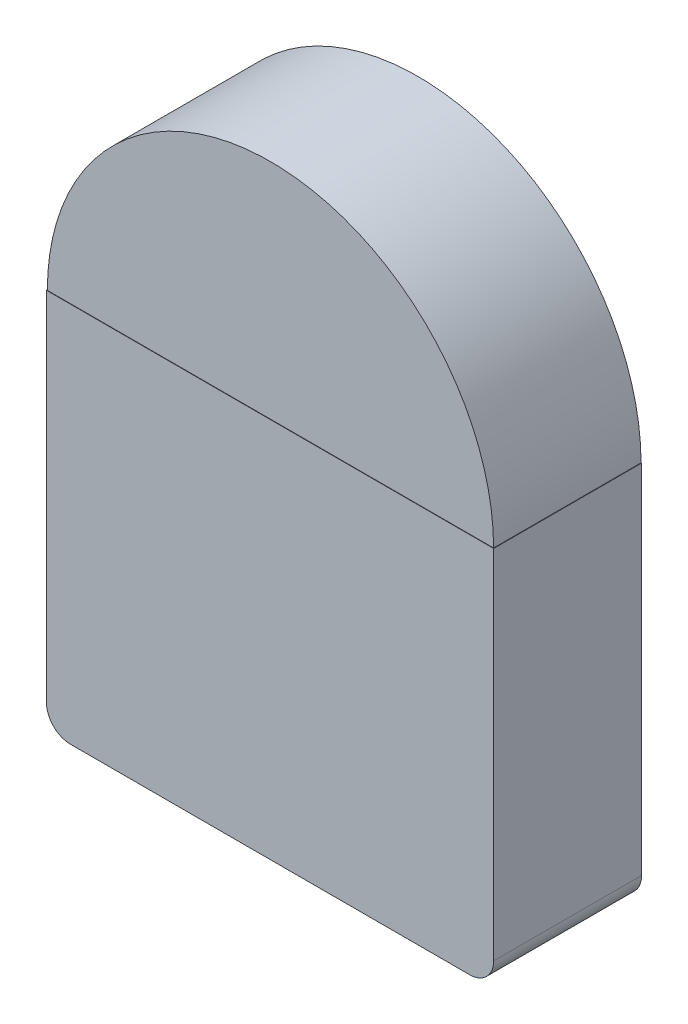
ISO-10303-21;
HEADER;
FILE_DESCRIPTION(('STEP AP214'),'2;1');
FILE_NAME('part.step','',(''),(''),'','','');
FILE_SCHEMA(('AUTOMOTIVE_DESIGN { 1 0 10303 214 1 1 1 1 }'));
ENDSEC;
DATA;
#1=APPLICATION_CONTEXT('core data for automotive mechanical design processes');
#2=APPLICATION_PROTOCOL_DEFINITION('international standard','automotive_design',2000,#1);
#3=PRODUCT_CONTEXT('',#1,'mechanical');
#4=PRODUCT('Part','Part','',(#3));
#5=PRODUCT_RELATED_PRODUCT_CATEGORY('part','',(#4));
#6=PRODUCT_DEFINITION_FORMATION('','',#4);
#7=PRODUCT_DEFINITION_CONTEXT('part definition',#1,'design');
#8=PRODUCT_DEFINITION('design','',#6,#7);
#9=PRODUCT_DEFINITION_SHAPE('','',#8);
#10=(LENGTH_UNIT() NAMED_UNIT(*) SI_UNIT(.MILLI.,.METRE.));
#11=(NAMED_UNIT(*) PLANE_ANGLE_UNIT() SI_UNIT($,.RADIAN.));
#12=(NAMED_UNIT(*) SI_UNIT($,.STERADIAN.) SOLID_ANGLE_UNIT());
#13=UNCERTAINTY_MEASURE_WITH_UNIT(LENGTH_MEASURE(1.E-05),#10,'distance_accuracy_value','');
#14=(GEOMETRIC_REPRESENTATION_CONTEXT(3) GLOBAL_UNCERTAINTY_ASSIGNED_CONTEXT((#13)) GLOBAL_UNIT_ASSIGNED_CONTEXT((#10,
#11,#12)) REPRESENTATION_CONTEXT('',''));
#15=CARTESIAN_POINT('',(0.,0.,0.));
#16=DIRECTION('',(0.,0.,1.));
#17=DIRECTION('',(1.,0.,0.));
#18=AXIS2_PLACEMENT_3D('',#15,#16,#17);
#19=CARTESIAN_POINT('',(-0.00127246753999985,0.,0.));
#20=DIRECTION('',(0.,0.,1.));
#21=DIRECTION('',(1.,0.,0.));
#22=AXIS2_PLACEMENT_3D('',#19,#20,#21);
#23=CYLINDRICAL_SURFACE('',#22,9.29);
#24=DIRECTION('',(0.,0.,-1.));
#25=VECTOR('',#24,1.);
#26=CARTESIAN_POINT('',(-9.29127246754,0.,1.5));
#27=LINE('',#26,#25);
#28=CARTESIAN_POINT('',(-9.29127246754,0.,6.14));
#29=VERTEX_POINT('',#28);
#30=CARTESIAN_POINT('',(-9.29127246754,0.,0.));
#31=VERTEX_POINT('',#30);
#32=EDGE_CURVE('E122',#29,#31,#27,.T.);
#33=ORIENTED_EDGE('',*,*,#32,.F.);
#34=CARTESIAN_POINT('',(-0.00127246753999985,0.,6.14));
#35=DIRECTION('',(0.,0.,1.));
#36=DIRECTION('',(1.,0.,0.));
#37=AXIS2_PLACEMENT_3D('',#34,#35,#36);
#38=CIRCLE('',#37,9.29);
#39=CARTESIAN_POINT('',(9.28872753246,0.,6.14));
#40=VERTEX_POINT('',#39);
#41=EDGE_CURVE('E110',#40,#29,#38,.T.);
#42=ORIENTED_EDGE('',*,*,#41,.F.);
#43=DIRECTION('',(0.,0.,-1.));
#44=VECTOR('',#43,1.);
#45=CARTESIAN_POINT('',(9.28872753246,0.,1.5));
#46=LINE('',#45,#44);
#47=CARTESIAN_POINT('',(9.28872753246,0.,0.));
#48=VERTEX_POINT('',#47);
#49=EDGE_CURVE('E125',#40,#48,#46,.T.);
#50=ORIENTED_EDGE('',*,*,#49,.T.);
#51=CARTESIAN_POINT('',(-0.00127246753999985,0.,0.));
#52=DIRECTION('',(0.,0.,1.));
#53=DIRECTION('',(1.,0.,0.));
#54=AXIS2_PLACEMENT_3D('',#51,#52,#53);
#55=CIRCLE('',#54,9.29);
#56=EDGE_CURVE('E131',#48,#31,#55,.T.);
#57=ORIENTED_EDGE('',*,*,#56,.T.);
#58=EDGE_LOOP('',(#33,#42,#50,#57));
#59=FACE_BOUND('',#58,.T.);
#60=ADVANCED_FACE('F45',(#59),#23,.T.);
#61=CARTESIAN_POINT('',(9.28872753246,0.,0.));
#62=DIRECTION('',(0.,0.,-1.));
#63=DIRECTION('',(-1.,0.,0.));
#64=AXIS2_PLACEMENT_3D('',#61,#62,#63);
#65=PLANE('',#64);
#66=DIRECTION('',(1.,0.,0.));
#67=VECTOR('',#66,1.);
#68=CARTESIAN_POINT('',(9.3087275324599,-15.8700000000001,0.));
#69=LINE('',#68,#67);
#70=CARTESIAN_POINT('',(-8.3112724675401,-15.8699999999999,0.));
#71=VERTEX_POINT('',#70);
#72=CARTESIAN_POINT('',(8.3087275324599,-15.8700000000001,0.));
#73=VERTEX_POINT('',#72);
#74=EDGE_CURVE('E175',#71,#73,#69,.T.);
#75=ORIENTED_EDGE('',*,*,#74,.F.);
#76=CARTESIAN_POINT('',(-8.31127246754009,-14.8699999999999,0.));
#77=DIRECTION('',(0.,0.,-1.));
#78=DIRECTION('',(-1.,0.,0.));
#79=AXIS2_PLACEMENT_3D('',#76,#77,#78);
#80=CIRCLE('',#79,1.);
#81=CARTESIAN_POINT('',(-9.31127246754009,-14.8699999999999,0.));
#82=VERTEX_POINT('',#81);
#83=EDGE_CURVE('E155',#71,#82,#80,.T.);
#84=ORIENTED_EDGE('',*,*,#83,.T.);
#85=DIRECTION('',(0.,1.,0.));
#86=VECTOR('',#85,1.);
#87=CARTESIAN_POINT('',(-9.3112724675401,-15.8699999999999,0.));
#88=LINE('',#87,#86);
#89=CARTESIAN_POINT('',(-9.31127246754,0.,0.));
#90=VERTEX_POINT('',#89);
#91=EDGE_CURVE('E181',#82,#90,#88,.T.);
#92=ORIENTED_EDGE('',*,*,#91,.T.);
#93=DIRECTION('',(1.,0.,0.));
#94=VECTOR('',#93,1.);
#95=CARTESIAN_POINT('',(9.30872753246,0.,0.));
#96=LINE('',#95,#94);
#97=EDGE_CURVE('E176',#90,#31,#96,.T.);
#98=ORIENTED_EDGE('',*,*,#97,.T.);
#99=ORIENTED_EDGE('',*,*,#56,.F.);
#100=CARTESIAN_POINT('',(9.30872753246,0.,0.));
#101=VERTEX_POINT('',#100);
#102=EDGE_CURVE('E195',#48,#101,#96,.T.);
#103=ORIENTED_EDGE('',*,*,#102,.T.);
#104=DIRECTION('',(0.,1.,0.));
#105=VECTOR('',#104,1.);
#106=CARTESIAN_POINT('',(9.3087275324599,-15.8700000000001,0.));
#107=LINE('',#106,#105);
#108=CARTESIAN_POINT('',(9.30872753245991,-14.8700000000001,0.));
#109=VERTEX_POINT('',#108);
#110=EDGE_CURVE('E187',#109,#101,#107,.T.);
#111=ORIENTED_EDGE('',*,*,#110,.F.);
#112=CARTESIAN_POINT('',(8.30872753245991,-14.8700000000001,0.));
#113=DIRECTION('',(0.,0.,-1.));
#114=DIRECTION('',(-1.,0.,0.));
#115=AXIS2_PLACEMENT_3D('',#112,#113,#114);
#116=CIRCLE('',#115,1.);
#117=EDGE_CURVE('E152',#109,#73,#116,.T.);
#118=ORIENTED_EDGE('',*,*,#117,.T.);
#119=EDGE_LOOP('',(#75,#84,#92,#98,#99,#103,#111,#118));
#120=FACE_BOUND('',#119,.T.);
#121=ADVANCED_FACE('F180',(#120),#65,.T.);
#122=CARTESIAN_POINT('',(9.3087275324599,-15.8700000000001,6.15669391474474));
#123=DIRECTION('',(-1.,0.,0.));
#124=DIRECTION('',(0.,-1.,0.));
#125=AXIS2_PLACEMENT_3D('',#122,#123,#124);
#126=PLANE('',#125);
#127=DIRECTION('',(0.,1.,0.));
#128=VECTOR('',#127,1.);
#129=CARTESIAN_POINT('',(9.3087275324599,-15.8700000000001,6.15669391474474));
#130=LINE('',#129,#128);
#131=CARTESIAN_POINT('',(9.30872753245991,-14.8700000000001,6.15669391474474));
#132=VERTEX_POINT('',#131);
#133=CARTESIAN_POINT('',(9.30872753246,0.,6.15669391474473));
#134=VERTEX_POINT('',#133);
#135=EDGE_CURVE('E133',#132,#134,#130,.T.);
#136=ORIENTED_EDGE('',*,*,#135,.F.);
#137=DIRECTION('',(0.,0.,1.));
#138=VECTOR('',#137,1.);
#139=CARTESIAN_POINT('',(9.30872753245991,-14.8700000000001,6.15669391474474));
#140=LINE('',#139,#138);
#141=EDGE_CURVE('E12',#132,#109,#140,.F.);
#142=ORIENTED_EDGE('',*,*,#141,.T.);
#143=ORIENTED_EDGE('',*,*,#110,.T.);
#144=DIRECTION('',(0.,0.,1.));
#145=VECTOR('',#144,1.);
#146=CARTESIAN_POINT('',(9.30872753246,0.,6.15669391474473));
#147=LINE('',#146,#145);
#148=EDGE_CURVE('E127',#101,#134,#147,.T.);
#149=ORIENTED_EDGE('',*,*,#148,.T.);
#150=EDGE_LOOP('',(#136,#142,#143,#149));
#151=FACE_BOUND('',#150,.T.);
#152=ADVANCED_FACE('F210',(#151),#126,.F.);
#153=CARTESIAN_POINT('',(-9.3112724675401,-15.8699999999999,6.15669391474474));
#154=DIRECTION('',(0.,0.,-1.));
#155=DIRECTION('',(0.,1.,0.));
#156=AXIS2_PLACEMENT_3D('',#153,#154,#155);
#157=PLANE('',#156);
#158=DIRECTION('',(0.,1.,0.));
#159=VECTOR('',#158,1.);
#160=CARTESIAN_POINT('',(-9.3112724675401,-15.8699999999999,6.15669391474474));
#161=LINE('',#160,#159);
#162=CARTESIAN_POINT('',(-9.31127246754009,-14.8699999999999,6.15669391474474));
#163=VERTEX_POINT('',#162);
#164=CARTESIAN_POINT('',(-9.31127246754,0.,6.15669391474473));
#165=VERTEX_POINT('',#164);
#166=EDGE_CURVE('E138',#163,#165,#161,.T.);
#167=ORIENTED_EDGE('',*,*,#166,.F.);
#168=CARTESIAN_POINT('',(-8.31127246754009,-14.8699999999999,6.15669391474474));
#169=DIRECTION('',(0.,0.,-1.));
#170=DIRECTION('',(0.,1.,0.));
#171=AXIS2_PLACEMENT_3D('',#168,#169,#170);
#172=CIRCLE('',#171,1.);
#173=CARTESIAN_POINT('',(-8.3112724675401,-15.8699999999999,6.15669391474474));
#174=VERTEX_POINT('',#173);
#175=EDGE_CURVE('E54',#163,#174,#172,.F.);
#176=ORIENTED_EDGE('',*,*,#175,.T.);
#177=DIRECTION('',(-1.,0.,0.));
#178=VECTOR('',#177,1.);
#179=CARTESIAN_POINT('',(-9.3112724675401,-15.8699999999999,6.15669391474474));
#180=LINE('',#179,#178);
#181=CARTESIAN_POINT('',(8.3087275324599,-15.87,6.15669391474474));
#182=VERTEX_POINT('',#181);
#183=EDGE_CURVE('E165',#182,#174,#180,.T.);
#184=ORIENTED_EDGE('',*,*,#183,.F.);
#185=CARTESIAN_POINT('',(8.30872753245991,-14.87,6.15669391474474));
#186=DIRECTION('',(0.,0.,-1.));
#187=DIRECTION('',(0.,1.,0.));
#188=AXIS2_PLACEMENT_3D('',#185,#186,#187);
#189=CIRCLE('',#188,1.);
#190=EDGE_CURVE('E61',#182,#132,#189,.F.);
#191=ORIENTED_EDGE('',*,*,#190,.T.);
#192=ORIENTED_EDGE('',*,*,#135,.T.);
#193=DIRECTION('',(-1.,0.,0.));
#194=VECTOR('',#193,1.);
#195=CARTESIAN_POINT('',(-9.31127246754,0.,6.15669391474473));
#196=LINE('',#195,#194);
#197=EDGE_CURVE('E198',#134,#165,#196,.T.);
#198=ORIENTED_EDGE('',*,*,#197,.T.);
#199=EDGE_LOOP('',(#167,#176,#184,#191,#192,#198));
#200=FACE_BOUND('',#199,.T.);
#201=ADVANCED_FACE('F164',(#200),#157,.F.);
#202=CARTESIAN_POINT('',(-9.3112724675401,-15.8699999999999,0.));
#203=DIRECTION('',(1.,0.,0.));
#204=DIRECTION('',(0.,1.,0.));
#205=AXIS2_PLACEMENT_3D('',#202,#203,#204);
#206=PLANE('',#205);
#207=ORIENTED_EDGE('',*,*,#91,.F.);
#208=DIRECTION('',(0.,0.,-1.));
#209=VECTOR('',#208,1.);
#210=CARTESIAN_POINT('',(-9.31127246754009,-14.8699999999999,0.));
#211=LINE('',#210,#209);
#212=EDGE_CURVE('E69',#82,#163,#211,.F.);
#213=ORIENTED_EDGE('',*,*,#212,.T.);
#214=ORIENTED_EDGE('',*,*,#166,.T.);
#215=DIRECTION('',(0.,0.,-1.));
#216=VECTOR('',#215,1.);
#217=CARTESIAN_POINT('',(-9.31127246754,0.,0.));
#218=LINE('',#217,#216);
#219=EDGE_CURVE('E185',#165,#90,#218,.T.);
#220=ORIENTED_EDGE('',*,*,#219,.T.);
#221=EDGE_LOOP('',(#207,#213,#214,#220));
#222=FACE_BOUND('',#221,.T.);
#223=ADVANCED_FACE('F183',(#222),#206,.F.);
#224=CARTESIAN_POINT('',(0.,-15.87,0.));
#225=DIRECTION('',(0.,1.,0.));
#226=DIRECTION('',(-1.,0.,0.));
#227=AXIS2_PLACEMENT_3D('',#224,#225,#226);
#228=PLANE('',#227);
#229=ORIENTED_EDGE('',*,*,#183,.T.);
#230=DIRECTION('',(0.,0.,-1.));
#231=VECTOR('',#230,1.);
#232=CARTESIAN_POINT('',(-8.3112724675401,-15.8699999999999,0.));
#233=LINE('',#232,#231);
#234=EDGE_CURVE('E148',#174,#71,#233,.T.);
#235=ORIENTED_EDGE('',*,*,#234,.T.);
#236=ORIENTED_EDGE('',*,*,#74,.T.);
#237=DIRECTION('',(0.,0.,1.));
#238=VECTOR('',#237,1.);
#239=CARTESIAN_POINT('',(8.3087275324599,-15.8700000000001,0.));
#240=LINE('',#239,#238);
#241=EDGE_CURVE('E144',#73,#182,#240,.T.);
#242=ORIENTED_EDGE('',*,*,#241,.T.);
#243=EDGE_LOOP('',(#229,#235,#236,#242));
#244=FACE_BOUND('',#243,.T.);
#245=ADVANCED_FACE('F170',(#244),#228,.F.);
#246=CARTESIAN_POINT('',(0.,0.,0.));
#247=DIRECTION('',(0.,1.,0.));
#248=DIRECTION('',(-1.,0.,0.));
#249=AXIS2_PLACEMENT_3D('',#246,#247,#248);
#250=PLANE('',#249);
#251=DIRECTION('',(1.,0.,0.));
#252=VECTOR('',#251,1.);
#253=CARTESIAN_POINT('',(-9.29127246754,0.,6.14));
#254=LINE('',#253,#252);
#255=EDGE_CURVE('E113',#29,#40,#254,.T.);
#256=ORIENTED_EDGE('',*,*,#255,.F.);
#257=ORIENTED_EDGE('',*,*,#32,.T.);
#258=ORIENTED_EDGE('',*,*,#97,.F.);
#259=ORIENTED_EDGE('',*,*,#219,.F.);
#260=ORIENTED_EDGE('',*,*,#197,.F.);
#261=ORIENTED_EDGE('',*,*,#148,.F.);
#262=ORIENTED_EDGE('',*,*,#102,.F.);
#263=ORIENTED_EDGE('',*,*,#49,.F.);
#264=EDGE_LOOP('',(#256,#257,#258,#259,#260,#261,#262,#263));
#265=FACE_BOUND('',#264,.T.);
#266=ADVANCED_FACE('F120',(#265),#250,.T.);
#267=CARTESIAN_POINT('',(-8.31127246754009,-14.8699999999999,0.));
#268=DIRECTION('',(0.,0.,-1.));
#269=DIRECTION('',(0.,1.,0.));
#270=AXIS2_PLACEMENT_3D('',#267,#268,#269);
#271=CYLINDRICAL_SURFACE('',#270,1.);
#272=ORIENTED_EDGE('',*,*,#175,.F.);
#273=ORIENTED_EDGE('',*,*,#212,.F.);
#274=ORIENTED_EDGE('',*,*,#83,.F.);
#275=ORIENTED_EDGE('',*,*,#234,.F.);
#276=EDGE_LOOP('',(#272,#273,#274,#275));
#277=FACE_BOUND('',#276,.T.);
#278=ADVANCED_FACE('F178',(#277),#271,.T.);
#279=CARTESIAN_POINT('',(8.30872753245991,-14.8700000000001,0.));
#280=DIRECTION('',(0.,0.,1.));
#281=DIRECTION('',(0.,-1.,0.));
#282=AXIS2_PLACEMENT_3D('',#279,#280,#281);
#283=CYLINDRICAL_SURFACE('',#282,1.);
#284=ORIENTED_EDGE('',*,*,#117,.F.);
#285=ORIENTED_EDGE('',*,*,#141,.F.);
#286=ORIENTED_EDGE('',*,*,#190,.F.);
#287=ORIENTED_EDGE('',*,*,#241,.F.);
#288=EDGE_LOOP('',(#284,#285,#286,#287));
#289=FACE_BOUND('',#288,.T.);
#290=ADVANCED_FACE('F47',(#289),#283,.T.);
#291=CARTESIAN_POINT('',(-0.00127246753999985,0.,6.14));
#292=DIRECTION('',(0.,0.,1.));
#293=DIRECTION('',(1.,0.,0.));
#294=AXIS2_PLACEMENT_3D('',#291,#292,#293);
#295=PLANE('',#294);
#296=ORIENTED_EDGE('',*,*,#41,.T.);
#297=ORIENTED_EDGE('',*,*,#255,.T.);
#298=EDGE_LOOP('',(#296,#297));
#299=FACE_BOUND('',#298,.T.);
#300=ADVANCED_FACE('F112',(#299),#295,.T.);
#301=CLOSED_SHELL('',(#60,#121,#152,#201,#223,#245,#266,#278,#290,#300));
#302=MANIFOLD_SOLID_BREP('B2',#301);
#303=ADVANCED_BREP_SHAPE_REPRESENTATION('',(#18,#302),#14);
#304=SHAPE_DEFINITION_REPRESENTATION(#9,#303);
ENDSEC;
END-ISO-10303-21;
